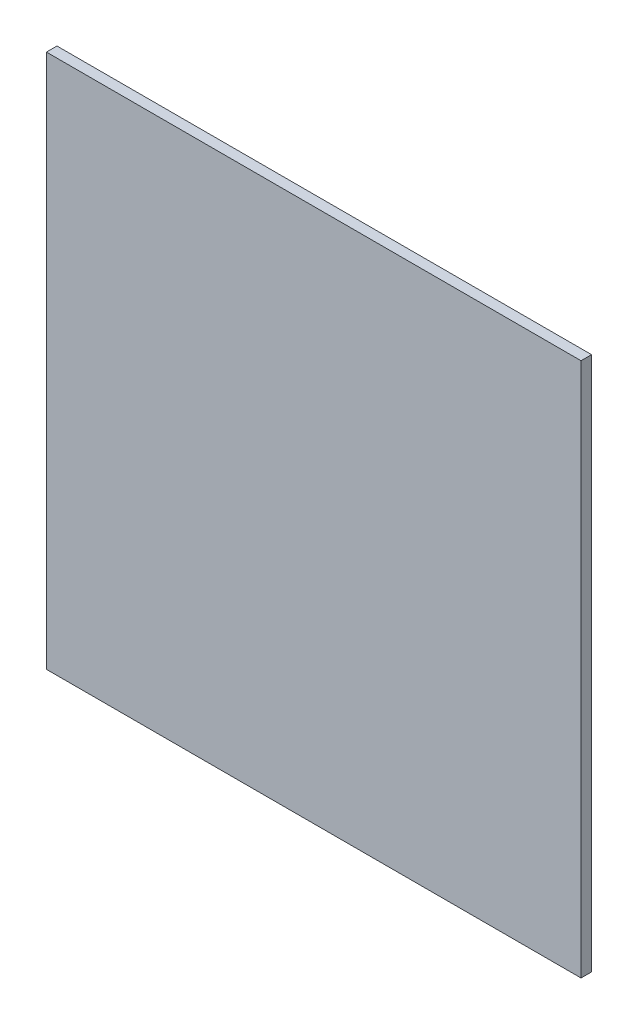
ISO-10303-21;
HEADER;
FILE_DESCRIPTION(('STEP AP214'),'2;1');
FILE_NAME('part.step','',(''),(''),'','','');
FILE_SCHEMA(('AUTOMOTIVE_DESIGN { 1 0 10303 214 1 1 1 1 }'));
ENDSEC;
DATA;
#1=APPLICATION_CONTEXT('core data for automotive mechanical design processes');
#2=APPLICATION_PROTOCOL_DEFINITION('international standard','automotive_design',2000,#1);
#3=PRODUCT_CONTEXT('',#1,'mechanical');
#4=PRODUCT('Part','Part','',(#3));
#5=PRODUCT_RELATED_PRODUCT_CATEGORY('part','',(#4));
#6=PRODUCT_DEFINITION_FORMATION('','',#4);
#7=PRODUCT_DEFINITION_CONTEXT('part definition',#1,'design');
#8=PRODUCT_DEFINITION('design','',#6,#7);
#9=PRODUCT_DEFINITION_SHAPE('','',#8);
#10=(LENGTH_UNIT() NAMED_UNIT(*) SI_UNIT(.MILLI.,.METRE.));
#11=(NAMED_UNIT(*) PLANE_ANGLE_UNIT() SI_UNIT($,.RADIAN.));
#12=(NAMED_UNIT(*) SI_UNIT($,.STERADIAN.) SOLID_ANGLE_UNIT());
#13=UNCERTAINTY_MEASURE_WITH_UNIT(LENGTH_MEASURE(1.E-05),#10,'distance_accuracy_value','');
#14=(GEOMETRIC_REPRESENTATION_CONTEXT(3) GLOBAL_UNCERTAINTY_ASSIGNED_CONTEXT((#13)) GLOBAL_UNIT_ASSIGNED_CONTEXT((#10,
#11,#12)) REPRESENTATION_CONTEXT('',''));
#15=CARTESIAN_POINT('',(0.,0.,0.));
#16=DIRECTION('',(0.,0.,1.));
#17=DIRECTION('',(1.,0.,0.));
#18=AXIS2_PLACEMENT_3D('',#15,#16,#17);
#19=CARTESIAN_POINT('',(-0.254,-0.254,0.));
#20=DIRECTION('',(-1.,0.,0.));
#21=DIRECTION('',(0.,1.,0.));
#22=AXIS2_PLACEMENT_3D('',#19,#20,#21);
#23=PLANE('',#22);
#24=DIRECTION('',(0.,0.,1.));
#25=VECTOR('',#24,1.);
#26=CARTESIAN_POINT('',(-0.254,-0.254,0.));
#27=LINE('',#26,#25);
#28=CARTESIAN_POINT('',(-0.254,-0.254,0.));
#29=VERTEX_POINT('',#28);
#30=CARTESIAN_POINT('',(-0.254,-0.254,0.00999998));
#31=VERTEX_POINT('',#30);
#32=EDGE_CURVE('E11',#29,#31,#27,.T.);
#33=ORIENTED_EDGE('',*,*,#32,.T.);
#34=DIRECTION('',(0.,1.,0.));
#35=VECTOR('',#34,1.);
#36=CARTESIAN_POINT('',(-0.254,-0.254,0.00999998));
#37=LINE('',#36,#35);
#38=CARTESIAN_POINT('',(-0.254,0.25399746,0.00999998));
#39=VERTEX_POINT('',#38);
#40=EDGE_CURVE('E25',#31,#39,#37,.T.);
#41=ORIENTED_EDGE('',*,*,#40,.T.);
#42=DIRECTION('',(0.,0.,1.));
#43=VECTOR('',#42,1.);
#44=CARTESIAN_POINT('',(-0.254,0.25399746,0.));
#45=LINE('',#44,#43);
#46=CARTESIAN_POINT('',(-0.254,0.25399746,0.));
#47=VERTEX_POINT('',#46);
#48=EDGE_CURVE('E73',#47,#39,#45,.T.);
#49=ORIENTED_EDGE('',*,*,#48,.F.);
#50=DIRECTION('',(0.,1.,0.));
#51=VECTOR('',#50,1.);
#52=CARTESIAN_POINT('',(-0.254,-0.254,0.));
#53=LINE('',#52,#51);
#54=EDGE_CURVE('E99',#29,#47,#53,.T.);
#55=ORIENTED_EDGE('',*,*,#54,.F.);
#56=EDGE_LOOP('',(#33,#41,#49,#55));
#57=FACE_BOUND('',#56,.T.);
#58=ADVANCED_FACE('F17',(#57),#23,.T.);
#59=CARTESIAN_POINT('',(-3.174984085572E-07,-3.174984085572E-07,0.));
#60=DIRECTION('',(0.,0.,-1.));
#61=DIRECTION('',(-1.,0.,0.));
#62=AXIS2_PLACEMENT_3D('',#59,#60,#61);
#63=PLANE('',#62);
#64=ORIENTED_EDGE('',*,*,#54,.T.);
#65=DIRECTION('',(0.9999999999875,4.9999999380845E-06,0.));
#66=VECTOR('',#65,1.);
#67=CARTESIAN_POINT('',(-0.254,0.25399746,0.));
#68=LINE('',#67,#66);
#69=CARTESIAN_POINT('',(0.254,0.254,0.));
#70=VERTEX_POINT('',#69);
#71=EDGE_CURVE('E95',#47,#70,#68,.T.);
#72=ORIENTED_EDGE('',*,*,#71,.T.);
#73=DIRECTION('',(-4.9999999380845E-06,-0.9999999999875,0.));
#74=VECTOR('',#73,1.);
#75=CARTESIAN_POINT('',(0.254,0.254,0.));
#76=LINE('',#75,#74);
#77=CARTESIAN_POINT('',(0.25399746,-0.254,0.));
#78=VERTEX_POINT('',#77);
#79=EDGE_CURVE('E68',#70,#78,#76,.T.);
#80=ORIENTED_EDGE('',*,*,#79,.T.);
#81=DIRECTION('',(-1.,0.,0.));
#82=VECTOR('',#81,1.);
#83=CARTESIAN_POINT('',(0.25399746,-0.254,0.));
#84=LINE('',#83,#82);
#85=EDGE_CURVE('E87',#78,#29,#84,.T.);
#86=ORIENTED_EDGE('',*,*,#85,.T.);
#87=EDGE_LOOP('',(#64,#72,#80,#86));
#88=FACE_BOUND('',#87,.T.);
#89=ADVANCED_FACE('F112',(#88),#63,.T.);
#90=CARTESIAN_POINT('',(0.25399746,-0.254,0.));
#91=DIRECTION('',(0.,-1.,0.));
#92=DIRECTION('',(-1.,0.,0.));
#93=AXIS2_PLACEMENT_3D('',#90,#91,#92);
#94=PLANE('',#93);
#95=DIRECTION('',(0.,0.,1.));
#96=VECTOR('',#95,1.);
#97=CARTESIAN_POINT('',(0.25399746,-0.254,0.));
#98=LINE('',#97,#96);
#99=CARTESIAN_POINT('',(0.25399746,-0.254,0.00999998));
#100=VERTEX_POINT('',#99);
#101=EDGE_CURVE('E83',#78,#100,#98,.T.);
#102=ORIENTED_EDGE('',*,*,#101,.T.);
#103=DIRECTION('',(-1.,0.,0.));
#104=VECTOR('',#103,1.);
#105=CARTESIAN_POINT('',(0.25399746,-0.254,0.00999998));
#106=LINE('',#105,#104);
#107=EDGE_CURVE('E60',#100,#31,#106,.T.);
#108=ORIENTED_EDGE('',*,*,#107,.T.);
#109=ORIENTED_EDGE('',*,*,#32,.F.);
#110=ORIENTED_EDGE('',*,*,#85,.F.);
#111=EDGE_LOOP('',(#102,#108,#109,#110));
#112=FACE_BOUND('',#111,.T.);
#113=ADVANCED_FACE('F119',(#112),#94,.T.);
#114=CARTESIAN_POINT('',(-3.174984085572E-07,-3.174984085572E-07,0.00999998));
#115=DIRECTION('',(0.,0.,-1.));
#116=DIRECTION('',(-1.,0.,0.));
#117=AXIS2_PLACEMENT_3D('',#114,#115,#116);
#118=PLANE('',#117);
#119=ORIENTED_EDGE('',*,*,#107,.F.);
#120=DIRECTION('',(-4.9999999380845E-06,-0.9999999999875,0.));
#121=VECTOR('',#120,1.);
#122=CARTESIAN_POINT('',(0.254,0.254,0.00999998));
#123=LINE('',#122,#121);
#124=CARTESIAN_POINT('',(0.254,0.254,0.00999998));
#125=VERTEX_POINT('',#124);
#126=EDGE_CURVE('E54',#125,#100,#123,.T.);
#127=ORIENTED_EDGE('',*,*,#126,.F.);
#128=DIRECTION('',(0.9999999999875,4.9999999380845E-06,0.));
#129=VECTOR('',#128,1.);
#130=CARTESIAN_POINT('',(-0.254,0.25399746,0.00999998));
#131=LINE('',#130,#129);
#132=EDGE_CURVE('E58',#39,#125,#131,.T.);
#133=ORIENTED_EDGE('',*,*,#132,.F.);
#134=ORIENTED_EDGE('',*,*,#40,.F.);
#135=EDGE_LOOP('',(#119,#127,#133,#134));
#136=FACE_BOUND('',#135,.T.);
#137=ADVANCED_FACE('F56',(#136),#118,.F.);
#138=CARTESIAN_POINT('',(-0.254,0.25399746,0.));
#139=DIRECTION('',(-4.9999999380845E-06,0.9999999999875,0.));
#140=DIRECTION('',(0.9999999999875,4.9999999380845E-06,0.));
#141=AXIS2_PLACEMENT_3D('',#138,#139,#140);
#142=PLANE('',#141);
#143=ORIENTED_EDGE('',*,*,#48,.T.);
#144=ORIENTED_EDGE('',*,*,#132,.T.);
#145=DIRECTION('',(0.,0.,1.));
#146=VECTOR('',#145,1.);
#147=CARTESIAN_POINT('',(0.254,0.254,0.));
#148=LINE('',#147,#146);
#149=EDGE_CURVE('E66',#70,#125,#148,.T.);
#150=ORIENTED_EDGE('',*,*,#149,.F.);
#151=ORIENTED_EDGE('',*,*,#71,.F.);
#152=EDGE_LOOP('',(#143,#144,#150,#151));
#153=FACE_BOUND('',#152,.T.);
#154=ADVANCED_FACE('F72',(#153),#142,.T.);
#155=CARTESIAN_POINT('',(0.254,0.254,0.));
#156=DIRECTION('',(0.9999999999875,-4.9999999380845E-06,0.));
#157=DIRECTION('',(-4.9999999380845E-06,-0.9999999999875,0.));
#158=AXIS2_PLACEMENT_3D('',#155,#156,#157);
#159=PLANE('',#158);
#160=ORIENTED_EDGE('',*,*,#149,.T.);
#161=ORIENTED_EDGE('',*,*,#126,.T.);
#162=ORIENTED_EDGE('',*,*,#101,.F.);
#163=ORIENTED_EDGE('',*,*,#79,.F.);
#164=EDGE_LOOP('',(#160,#161,#162,#163));
#165=FACE_BOUND('',#164,.T.);
#166=ADVANCED_FACE('F67',(#165),#159,.T.);
#167=CLOSED_SHELL('',(#58,#89,#113,#137,#154,#166));
#168=MANIFOLD_SOLID_BREP('B1',#167);
#169=ADVANCED_BREP_SHAPE_REPRESENTATION('',(#18,#168),#14);
#170=SHAPE_DEFINITION_REPRESENTATION(#9,#169);
ENDSEC;
END-ISO-10303-21;
